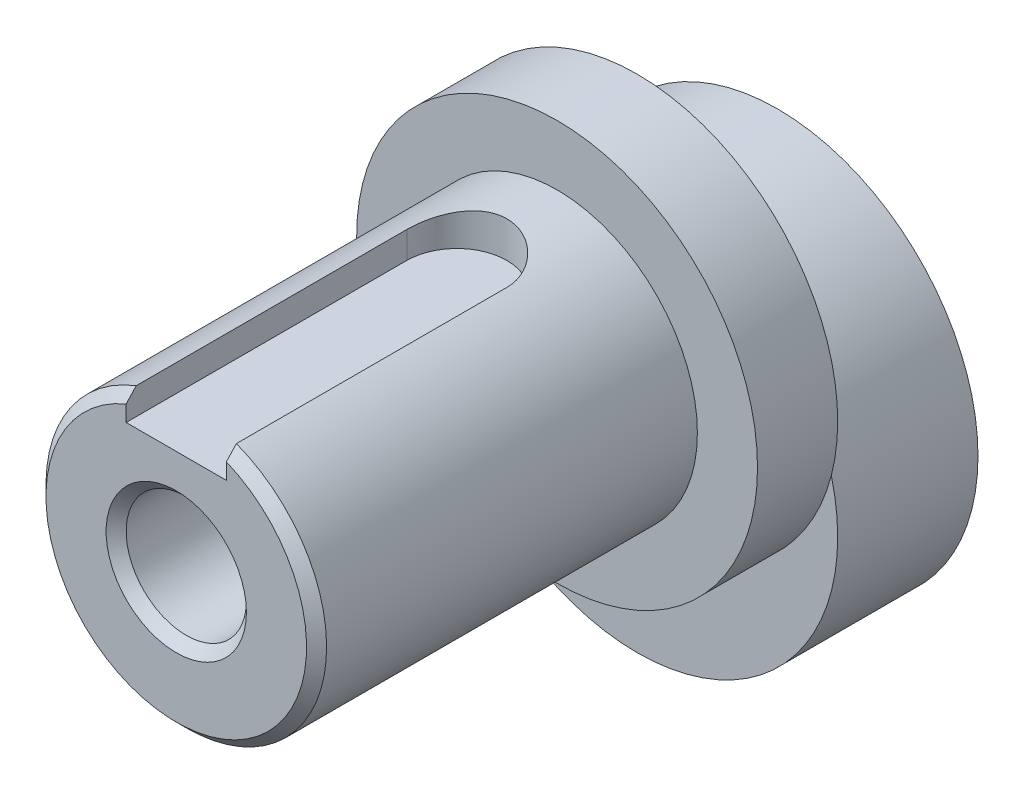
ISO-10303-21;
HEADER;
FILE_DESCRIPTION(('STEP AP214'),'2;1');
FILE_NAME('part.step','',(''),(''),'','','');
FILE_SCHEMA(('AUTOMOTIVE_DESIGN { 1 0 10303 214 1 1 1 1 }'));
ENDSEC;
DATA;
#1=APPLICATION_CONTEXT('core data for automotive mechanical design processes');
#2=APPLICATION_PROTOCOL_DEFINITION('international standard','automotive_design',2000,#1);
#3=PRODUCT_CONTEXT('',#1,'mechanical');
#4=PRODUCT('Part','Part','',(#3));
#5=PRODUCT_RELATED_PRODUCT_CATEGORY('part','',(#4));
#6=PRODUCT_DEFINITION_FORMATION('','',#4);
#7=PRODUCT_DEFINITION_CONTEXT('part definition',#1,'design');
#8=PRODUCT_DEFINITION('design','',#6,#7);
#9=PRODUCT_DEFINITION_SHAPE('','',#8);
#10=(LENGTH_UNIT() NAMED_UNIT(*) SI_UNIT(.MILLI.,.METRE.));
#11=(NAMED_UNIT(*) PLANE_ANGLE_UNIT() SI_UNIT($,.RADIAN.));
#12=(NAMED_UNIT(*) SI_UNIT($,.STERADIAN.) SOLID_ANGLE_UNIT());
#13=UNCERTAINTY_MEASURE_WITH_UNIT(LENGTH_MEASURE(1.E-05),#10,'distance_accuracy_value','');
#14=(GEOMETRIC_REPRESENTATION_CONTEXT(3) GLOBAL_UNCERTAINTY_ASSIGNED_CONTEXT((#13)) GLOBAL_UNIT_ASSIGNED_CONTEXT((#10,
#11,#12)) REPRESENTATION_CONTEXT('',''));
#15=CARTESIAN_POINT('',(0.,0.,0.));
#16=DIRECTION('',(0.,0.,1.));
#17=DIRECTION('',(1.,0.,0.));
#18=AXIS2_PLACEMENT_3D('',#15,#16,#17);
#19=CARTESIAN_POINT('',(0.,5.,30.));
#20=DIRECTION('',(0.,0.,-1.));
#21=DIRECTION('',(-1.,0.,0.));
#22=AXIS2_PLACEMENT_3D('',#19,#20,#21);
#23=CYLINDRICAL_SURFACE('',#22,7.);
#24=CARTESIAN_POINT('',(0.,5.,11.));
#25=DIRECTION('',(0.,0.,1.));
#26=DIRECTION('',(1.,0.,0.));
#27=AXIS2_PLACEMENT_3D('',#24,#25,#26);
#28=CIRCLE('',#27,7.);
#29=CARTESIAN_POINT('',(7.,5.,11.));
#30=VERTEX_POINT('',#29);
#31=EDGE_CURVE('E136',#30,#30,#28,.T.);
#32=ORIENTED_EDGE('',*,*,#31,.T.);
#33=EDGE_LOOP('',(#32));
#34=FACE_BOUND('',#33,.T.);
#35=DIRECTION('',(0.,0.,-1.));
#36=VECTOR('',#35,1.);
#37=CARTESIAN_POINT('',(2.5,11.538348415311,30.));
#38=LINE('',#37,#36);
#39=CARTESIAN_POINT('',(2.5,11.538348415311,16.));
#40=VERTEX_POINT('',#39);
#41=CARTESIAN_POINT('',(2.5,11.538348415311,29.5));
#42=VERTEX_POINT('',#41);
#43=EDGE_CURVE('E114',#40,#42,#38,.F.);
#44=ORIENTED_EDGE('',*,*,#43,.T.);
#45=CARTESIAN_POINT('',(0.,5.,29.5));
#46=DIRECTION('',(0.,0.,1.));
#47=DIRECTION('',(1.,0.,0.));
#48=AXIS2_PLACEMENT_3D('',#45,#46,#47);
#49=CIRCLE('',#48,7.);
#50=CARTESIAN_POINT('',(-2.5,11.538348415311,29.5));
#51=VERTEX_POINT('',#50);
#52=EDGE_CURVE('E60',#42,#51,#49,.F.);
#53=ORIENTED_EDGE('',*,*,#52,.T.);
#54=DIRECTION('',(0.,0.,-1.));
#55=VECTOR('',#54,1.);
#56=CARTESIAN_POINT('',(-2.5,11.538348415311,30.));
#57=LINE('',#56,#55);
#58=CARTESIAN_POINT('',(-2.5,11.538348415311,16.));
#59=VERTEX_POINT('',#58);
#60=EDGE_CURVE('E133',#59,#51,#57,.F.);
#61=ORIENTED_EDGE('',*,*,#60,.F.);
#62=CARTESIAN_POINT('',(2.5,11.538348415311,16.));
#63=CARTESIAN_POINT('',(2.50000932220904,11.5383365378513,15.9321107542711));
#64=CARTESIAN_POINT('',(2.49723485076694,11.5394054992274,15.8642280673609));
#65=CARTESIAN_POINT('',(2.4861910211816,11.5436165747813,15.7289960893886));
#66=CARTESIAN_POINT('',(2.47792334551208,11.5467580541806,15.6616466413939));
#67=CARTESIAN_POINT('',(2.456001752859,11.5550121763794,15.5281785853972));
#68=CARTESIAN_POINT('',(2.44236559963955,11.5601183170568,15.4620566636602));
#69=CARTESIAN_POINT('',(2.40985115466648,11.5721317785417,15.3312981648915));
#70=CARTESIAN_POINT('',(2.39097263107436,11.5790391790075,15.2666616536876));
#71=CARTESIAN_POINT('',(2.32673964179205,11.6021493436571,15.0757356335225));
#72=CARTESIAN_POINT('',(2.27375112606986,11.6207547534084,14.9522095478644));
#73=CARTESIAN_POINT('',(2.14910757865425,11.6622539736071,14.715769666872));
#74=CARTESIAN_POINT('',(2.07743895048849,11.6851509042488,14.6028636832645));
#75=CARTESIAN_POINT('',(1.9140257110197,11.7337991379222,14.3857847866473));
#76=CARTESIAN_POINT('',(1.82158337146744,11.7596286404137,14.2821535248041));
#77=CARTESIAN_POINT('',(1.6207338877633,11.8105759232303,14.0914912952836));
#78=CARTESIAN_POINT('',(1.51232377552674,11.8356935701987,14.0044634207566));
#79=CARTESIAN_POINT('',(1.27853915335934,11.8833113327905,13.846910144545));
#80=CARTESIAN_POINT('',(1.15274833789185,11.905708352238,13.7769684781395));
#81=CARTESIAN_POINT('',(0.890250825476635,11.9444235767263,13.6594633532026));
#82=CARTESIAN_POINT('',(0.753547890540327,11.9607438658547,13.611892220954));
#83=CARTESIAN_POINT('',(0.478829979256175,11.9849105051071,13.5423593978176));
#84=CARTESIAN_POINT('',(0.341079835227466,11.9930659435251,13.5194608695289));
#85=CARTESIAN_POINT('',(0.0634643052969036,12.0010879805382,13.4969315972224));
#86=CARTESIAN_POINT('',(-0.0764004845074483,12.000956873027,13.4972944139653));
#87=CARTESIAN_POINT('',(-0.347593258486946,11.9926225804908,13.5207112737611));
#88=CARTESIAN_POINT('',(-0.479022407078721,11.9847824358352,13.5427447941985));
#89=CARTESIAN_POINT('',(-0.736175812143608,11.9623783250735,13.6071734241588));
#90=CARTESIAN_POINT('',(-0.861899745780465,11.9478139789904,13.6495696843625));
#91=CARTESIAN_POINT('',(-1.10616102429807,11.9131650689037,13.7540469115653));
#92=CARTESIAN_POINT('',(-1.22457279066906,11.8930059216431,13.8163957149601));
#93=CARTESIAN_POINT('',(-1.44953531305523,11.8492335561632,13.9587793352234));
#94=CARTESIAN_POINT('',(-1.55608245176771,11.8256192895926,14.0388195237836));
#95=CARTESIAN_POINT('',(-1.7603244525607,11.7759054780549,14.2193232636567));
#96=CARTESIAN_POINT('',(-1.85724185700418,11.7497405584388,14.3206497231449));
#97=CARTESIAN_POINT('',(-2.03299914621297,11.6989034246897,14.5383273641656));
#98=CARTESIAN_POINT('',(-2.11183255456462,11.6742317476526,14.6546839051685));
#99=CARTESIAN_POINT('',(-2.25049860898459,11.628778038754,14.901942598522));
#100=CARTESIAN_POINT('',(-2.30994207989626,11.6080787511899,15.0330789755054));
#101=CARTESIAN_POINT('',(-2.4055543972585,11.5738821361027,15.3043648015822));
#102=CARTESIAN_POINT('',(-2.44176119399954,11.5603730716505,15.444499141169));
#103=CARTESIAN_POINT('',(-2.47705497148627,11.5470854224556,15.6550305442642));
#104=CARTESIAN_POINT('',(-2.48565347586445,11.5438201096791,15.7237363017718));
#105=CARTESIAN_POINT('',(-2.49712352174882,11.5394491082968,15.8616151641917));
#106=CARTESIAN_POINT('',(-2.50000139665367,11.5383410314093,15.9307876671005));
#107=CARTESIAN_POINT('',(-2.5,11.538348415311,16.));
#108=B_SPLINE_CURVE_WITH_KNOTS('',3,(#62,#63,#64,#65,#66,#67,#68,#69,#70,#71,#72,#73,#74,#75,
#76,#77,#78,#79,#80,#81,#82,#83,#84,#85,#86,#87,#88,#89,#90,#91,#92,#93,#94,#95,#96,#97,#98,#99,
#100,#101,#102,#103,#104,#105,#106,#107),.UNSPECIFIED.,.F.,.F.,(4,2,2,2,2,2,2,2,2,2,2,2,2,2,2,2,
2,2,2,2,2,2,4),(0.,0.203591628551589,0.40712092922553,0.609982356545745,0.812852756635989,
1.21793118555512,1.6233052814847,2.0451597231193,2.4670926781184,2.90188398965561,
3.33652604665238,3.75400993940862,4.17137826416923,4.56998920861347,4.96862268086888,
5.3728490944864,5.77719841367922,6.20315837945088,6.62927065674721,7.06347329058505,
7.49696496492445,7.70468580162773,7.91217653896404),.UNSPECIFIED.);
#109=EDGE_CURVE('E112',#40,#59,#108,.T.);
#110=ORIENTED_EDGE('',*,*,#109,.F.);
#111=EDGE_LOOP('',(#44,#53,#61,#110));
#112=FACE_BOUND('',#111,.T.);
#113=ADVANCED_FACE('F45',(#34,#112),#23,.T.);
#114=CARTESIAN_POINT('',(0.,5.,30.));
#115=DIRECTION('',(0.,0.,1.));
#116=DIRECTION('',(1.,0.,0.));
#117=AXIS2_PLACEMENT_3D('',#114,#115,#116);
#118=PLANE('',#117);
#119=CARTESIAN_POINT('',(0.,5.,30.));
#120=DIRECTION('',(0.,0.,1.));
#121=DIRECTION('',(1.,0.,0.));
#122=AXIS2_PLACEMENT_3D('',#119,#120,#121);
#123=CIRCLE('',#122,3.50000000000001);
#124=CARTESIAN_POINT('',(3.50000000000001,5.,30.));
#125=VERTEX_POINT('',#124);
#126=EDGE_CURVE('E161',#125,#125,#123,.F.);
#127=ORIENTED_EDGE('',*,*,#126,.T.);
#128=EDGE_LOOP('',(#127));
#129=FACE_BOUND('',#128,.T.);
#130=DIRECTION('',(0.,1.,0.));
#131=VECTOR('',#130,1.);
#132=CARTESIAN_POINT('',(-2.5,5.,30.));
#133=LINE('',#132,#131);
#134=CARTESIAN_POINT('',(-2.5,10.2,30.));
#135=VERTEX_POINT('',#134);
#136=CARTESIAN_POINT('',(-2.5,11.,30.));
#137=VERTEX_POINT('',#136);
#138=EDGE_CURVE('E121',#135,#137,#133,.T.);
#139=ORIENTED_EDGE('',*,*,#138,.T.);
#140=CARTESIAN_POINT('',(0.,5.,30.));
#141=DIRECTION('',(0.,0.,1.));
#142=DIRECTION('',(1.,0.,0.));
#143=AXIS2_PLACEMENT_3D('',#140,#141,#142);
#144=CIRCLE('',#143,6.5);
#145=CARTESIAN_POINT('',(2.5,11.,30.));
#146=VERTEX_POINT('',#145);
#147=EDGE_CURVE('E176',#137,#146,#144,.T.);
#148=ORIENTED_EDGE('',*,*,#147,.T.);
#149=DIRECTION('',(0.,1.,0.));
#150=VECTOR('',#149,1.);
#151=CARTESIAN_POINT('',(2.5,5.,30.));
#152=LINE('',#151,#150);
#153=CARTESIAN_POINT('',(2.5,10.2,30.));
#154=VERTEX_POINT('',#153);
#155=EDGE_CURVE('E166',#154,#146,#152,.T.);
#156=ORIENTED_EDGE('',*,*,#155,.F.);
#157=DIRECTION('',(-1.,0.,0.));
#158=VECTOR('',#157,1.);
#159=CARTESIAN_POINT('',(0.,10.2,30.));
#160=LINE('',#159,#158);
#161=EDGE_CURVE('E164',#154,#135,#160,.T.);
#162=ORIENTED_EDGE('',*,*,#161,.T.);
#163=EDGE_LOOP('',(#139,#148,#156,#162));
#164=FACE_BOUND('',#163,.T.);
#165=ADVANCED_FACE('F192',(#129,#164),#118,.T.);
#166=CARTESIAN_POINT('',(0.,0.,7.));
#167=DIRECTION('',(0.,0.,-1.));
#168=DIRECTION('',(-1.,0.,0.));
#169=AXIS2_PLACEMENT_3D('',#166,#167,#168);
#170=CYLINDRICAL_SURFACE('',#169,10.);
#171=CARTESIAN_POINT('',(0.,0.,7.));
#172=DIRECTION('',(0.,0.,1.));
#173=DIRECTION('',(1.,0.,0.));
#174=AXIS2_PLACEMENT_3D('',#171,#172,#173);
#175=CIRCLE('',#174,10.);
#176=CARTESIAN_POINT('',(9.68245836551854,2.5,7.));
#177=VERTEX_POINT('',#176);
#178=CARTESIAN_POINT('',(-9.68245836551854,2.5,7.));
#179=VERTEX_POINT('',#178);
#180=EDGE_CURVE('E140',#177,#179,#175,.T.);
#181=ORIENTED_EDGE('',*,*,#180,.F.);
#182=EDGE_CURVE('E150',#179,#177,#175,.T.);
#183=ORIENTED_EDGE('',*,*,#182,.F.);
#184=EDGE_LOOP('',(#181,#183));
#185=FACE_BOUND('',#184,.T.);
#186=CARTESIAN_POINT('',(0.,0.,0.));
#187=DIRECTION('',(0.,0.,1.));
#188=DIRECTION('',(1.,0.,0.));
#189=AXIS2_PLACEMENT_3D('',#186,#187,#188);
#190=CIRCLE('',#189,10.);
#191=CARTESIAN_POINT('',(10.,0.,0.));
#192=VERTEX_POINT('',#191);
#193=EDGE_CURVE('E144',#192,#192,#190,.T.);
#194=ORIENTED_EDGE('',*,*,#193,.T.);
#195=EDGE_LOOP('',(#194));
#196=FACE_BOUND('',#195,.T.);
#197=ADVANCED_FACE('F194',(#185,#196),#170,.T.);
#198=CARTESIAN_POINT('',(0.,0.,7.));
#199=DIRECTION('',(0.,0.,1.));
#200=DIRECTION('',(1.,0.,0.));
#201=AXIS2_PLACEMENT_3D('',#198,#199,#200);
#202=PLANE('',#201);
#203=CARTESIAN_POINT('',(0.,5.,7.));
#204=DIRECTION('',(0.,0.,1.));
#205=DIRECTION('',(1.,0.,0.));
#206=AXIS2_PLACEMENT_3D('',#203,#204,#205);
#207=CIRCLE('',#206,10.);
#208=EDGE_CURVE('E145',#179,#177,#207,.T.);
#209=ORIENTED_EDGE('',*,*,#208,.F.);
#210=ORIENTED_EDGE('',*,*,#182,.T.);
#211=EDGE_LOOP('',(#209,#210));
#212=FACE_BOUND('',#211,.T.);
#213=ADVANCED_FACE('F200',(#212),#202,.T.);
#214=CARTESIAN_POINT('',(0.,0.,0.));
#215=DIRECTION('',(0.,0.,1.));
#216=DIRECTION('',(1.,0.,0.));
#217=AXIS2_PLACEMENT_3D('',#214,#215,#216);
#218=PLANE('',#217);
#219=CARTESIAN_POINT('',(0.,5.,0.));
#220=DIRECTION('',(0.,0.,1.));
#221=DIRECTION('',(1.,0.,0.));
#222=AXIS2_PLACEMENT_3D('',#219,#220,#221);
#223=CIRCLE('',#222,3.5);
#224=CARTESIAN_POINT('',(3.5,5.,0.));
#225=VERTEX_POINT('',#224);
#226=EDGE_CURVE('E139',#225,#225,#223,.T.);
#227=ORIENTED_EDGE('',*,*,#226,.T.);
#228=EDGE_LOOP('',(#227));
#229=FACE_BOUND('',#228,.T.);
#230=ORIENTED_EDGE('',*,*,#193,.F.);
#231=EDGE_LOOP('',(#230));
#232=FACE_BOUND('',#231,.T.);
#233=ADVANCED_FACE('F302',(#229,#232),#218,.F.);
#234=CARTESIAN_POINT('',(0.,5.,7.));
#235=DIRECTION('',(0.,0.,1.));
#236=DIRECTION('',(1.,0.,0.));
#237=AXIS2_PLACEMENT_3D('',#234,#235,#236);
#238=PLANE('',#237);
#239=EDGE_CURVE('E135',#177,#179,#207,.T.);
#240=ORIENTED_EDGE('',*,*,#239,.F.);
#241=ORIENTED_EDGE('',*,*,#180,.T.);
#242=EDGE_LOOP('',(#240,#241));
#243=FACE_BOUND('',#242,.T.);
#244=ADVANCED_FACE('F292',(#243),#238,.F.);
#245=CARTESIAN_POINT('',(0.,5.,11.));
#246=DIRECTION('',(0.,0.,-1.));
#247=DIRECTION('',(-1.,0.,0.));
#248=AXIS2_PLACEMENT_3D('',#245,#246,#247);
#249=CYLINDRICAL_SURFACE('',#248,10.);
#250=CARTESIAN_POINT('',(0.,5.,11.));
#251=DIRECTION('',(0.,0.,1.));
#252=DIRECTION('',(1.,0.,0.));
#253=AXIS2_PLACEMENT_3D('',#250,#251,#252);
#254=CIRCLE('',#253,10.);
#255=CARTESIAN_POINT('',(10.,5.,11.));
#256=VERTEX_POINT('',#255);
#257=EDGE_CURVE('E141',#256,#256,#254,.T.);
#258=ORIENTED_EDGE('',*,*,#257,.F.);
#259=EDGE_LOOP('',(#258));
#260=FACE_BOUND('',#259,.T.);
#261=ORIENTED_EDGE('',*,*,#208,.T.);
#262=ORIENTED_EDGE('',*,*,#239,.T.);
#263=EDGE_LOOP('',(#261,#262));
#264=FACE_BOUND('',#263,.T.);
#265=ADVANCED_FACE('F283',(#260,#264),#249,.T.);
#266=CARTESIAN_POINT('',(0.,5.,11.));
#267=DIRECTION('',(0.,0.,1.));
#268=DIRECTION('',(1.,0.,0.));
#269=AXIS2_PLACEMENT_3D('',#266,#267,#268);
#270=PLANE('',#269);
#271=ORIENTED_EDGE('',*,*,#31,.F.);
#272=EDGE_LOOP('',(#271));
#273=FACE_BOUND('',#272,.T.);
#274=ORIENTED_EDGE('',*,*,#257,.T.);
#275=EDGE_LOOP('',(#274));
#276=FACE_BOUND('',#275,.T.);
#277=ADVANCED_FACE('F190',(#273,#276),#270,.T.);
#278=CARTESIAN_POINT('',(0.,5.,0.));
#279=DIRECTION('',(0.,0.,1.));
#280=DIRECTION('',(1.,0.,0.));
#281=AXIS2_PLACEMENT_3D('',#278,#279,#280);
#282=CYLINDRICAL_SURFACE('',#281,3.);
#283=CARTESIAN_POINT('',(0.,5.,0.500000000000003));
#284=DIRECTION('',(0.,0.,1.));
#285=DIRECTION('',(1.,0.,0.));
#286=AXIS2_PLACEMENT_3D('',#283,#284,#285);
#287=CIRCLE('',#286,3.);
#288=CARTESIAN_POINT('',(3.,5.,0.500000000000003));
#289=VERTEX_POINT('',#288);
#290=EDGE_CURVE('E158',#289,#289,#287,.F.);
#291=ORIENTED_EDGE('',*,*,#290,.T.);
#292=EDGE_LOOP('',(#291));
#293=FACE_BOUND('',#292,.T.);
#294=CARTESIAN_POINT('',(0.,5.,29.5));
#295=DIRECTION('',(0.,0.,1.));
#296=DIRECTION('',(1.,0.,0.));
#297=AXIS2_PLACEMENT_3D('',#294,#295,#296);
#298=CIRCLE('',#297,3.);
#299=CARTESIAN_POINT('',(3.,5.,29.5));
#300=VERTEX_POINT('',#299);
#301=EDGE_CURVE('E155',#300,#300,#298,.T.);
#302=ORIENTED_EDGE('',*,*,#301,.T.);
#303=EDGE_LOOP('',(#302));
#304=FACE_BOUND('',#303,.T.);
#305=ADVANCED_FACE('F187',(#293,#304),#282,.F.);
#306=CARTESIAN_POINT('',(0.,5.,0.));
#307=DIRECTION('',(0.,0.,-1.));
#308=DIRECTION('',(-1.,0.,0.));
#309=AXIS2_PLACEMENT_3D('',#306,#307,#308);
#310=CONICAL_SURFACE('',#309,3.5,0.785398163397445);
#311=ORIENTED_EDGE('',*,*,#290,.F.);
#312=EDGE_LOOP('',(#311));
#313=FACE_BOUND('',#312,.T.);
#314=ORIENTED_EDGE('',*,*,#226,.F.);
#315=EDGE_LOOP('',(#314));
#316=FACE_BOUND('',#315,.T.);
#317=ADVANCED_FACE('F189',(#313,#316),#310,.F.);
#318=CARTESIAN_POINT('',(0.,5.,29.5));
#319=DIRECTION('',(0.,0.,1.));
#320=DIRECTION('',(1.,0.,0.));
#321=AXIS2_PLACEMENT_3D('',#318,#319,#320);
#322=CONICAL_SURFACE('',#321,3.,0.785398163397458);
#323=ORIENTED_EDGE('',*,*,#126,.F.);
#324=EDGE_LOOP('',(#323));
#325=FACE_BOUND('',#324,.T.);
#326=ORIENTED_EDGE('',*,*,#301,.F.);
#327=EDGE_LOOP('',(#326));
#328=FACE_BOUND('',#327,.T.);
#329=ADVANCED_FACE('F184',(#325,#328),#322,.F.);
#330=CARTESIAN_POINT('',(0.,15.,16.));
#331=DIRECTION('',(0.,-1.,0.));
#332=DIRECTION('',(0.,0.,-1.));
#333=AXIS2_PLACEMENT_3D('',#330,#331,#332);
#334=CYLINDRICAL_SURFACE('',#333,2.5);
#335=ORIENTED_EDGE('',*,*,#109,.T.);
#336=DIRECTION('',(0.,-1.,0.));
#337=VECTOR('',#336,1.);
#338=CARTESIAN_POINT('',(-2.5,15.,16.));
#339=LINE('',#338,#337);
#340=CARTESIAN_POINT('',(-2.5,10.2,16.));
#341=VERTEX_POINT('',#340);
#342=EDGE_CURVE('E104',#59,#341,#339,.T.);
#343=ORIENTED_EDGE('',*,*,#342,.T.);
#344=CARTESIAN_POINT('',(0.,10.2,16.));
#345=DIRECTION('',(0.,1.,0.));
#346=DIRECTION('',(0.,0.,1.));
#347=AXIS2_PLACEMENT_3D('',#344,#345,#346);
#348=CIRCLE('',#347,2.5);
#349=CARTESIAN_POINT('',(2.5,10.2,16.));
#350=VERTEX_POINT('',#349);
#351=EDGE_CURVE('E109',#350,#341,#348,.T.);
#352=ORIENTED_EDGE('',*,*,#351,.F.);
#353=DIRECTION('',(0.,-1.,0.));
#354=VECTOR('',#353,1.);
#355=CARTESIAN_POINT('',(2.5,15.,16.));
#356=LINE('',#355,#354);
#357=EDGE_CURVE('E115',#40,#350,#356,.T.);
#358=ORIENTED_EDGE('',*,*,#357,.F.);
#359=EDGE_LOOP('',(#335,#343,#352,#358));
#360=FACE_BOUND('',#359,.T.);
#361=ADVANCED_FACE('F106',(#360),#334,.F.);
#362=CARTESIAN_POINT('',(-2.5,15.,16.));
#363=DIRECTION('',(1.,0.,0.));
#364=DIRECTION('',(0.,0.,-1.));
#365=AXIS2_PLACEMENT_3D('',#362,#363,#364);
#366=PLANE('',#365);
#367=ORIENTED_EDGE('',*,*,#60,.T.);
#368=CARTESIAN_POINT('',(-2.5,11.538348415311,29.5));
#369=CARTESIAN_POINT('',(-2.5,11.4488688143681,29.5835972549309));
#370=CARTESIAN_POINT('',(-2.5,11.3592666495585,29.6670625457351));
#371=CARTESIAN_POINT('',(-2.5,11.1798171778274,29.833729212444));
#372=CARTESIAN_POINT('',(-2.5,11.0899698708667,29.9169305883065));
#373=CARTESIAN_POINT('',(-2.5,11.,30.));
#374=B_SPLINE_CURVE_WITH_KNOTS('',3,(#368,#369,#370,#371,#372,#373),.UNSPECIFIED.,.F.,.F.,(4,2,
4),(0.,0.36736225223653,0.734724563343169),.UNSPECIFIED.);
#375=EDGE_CURVE('E11',#51,#137,#374,.T.);
#376=ORIENTED_EDGE('',*,*,#375,.T.);
#377=ORIENTED_EDGE('',*,*,#138,.F.);
#378=DIRECTION('',(0.,0.,1.));
#379=VECTOR('',#378,1.);
#380=CARTESIAN_POINT('',(-2.5,10.2,16.));
#381=LINE('',#380,#379);
#382=EDGE_CURVE('E118',#341,#135,#381,.T.);
#383=ORIENTED_EDGE('',*,*,#382,.F.);
#384=ORIENTED_EDGE('',*,*,#342,.F.);
#385=EDGE_LOOP('',(#367,#376,#377,#383,#384));
#386=FACE_BOUND('',#385,.T.);
#387=ADVANCED_FACE('F119',(#386),#366,.T.);
#388=CARTESIAN_POINT('',(2.5,15.,16.));
#389=DIRECTION('',(1.,0.,0.));
#390=DIRECTION('',(0.,0.,-1.));
#391=AXIS2_PLACEMENT_3D('',#388,#389,#390);
#392=PLANE('',#391);
#393=ORIENTED_EDGE('',*,*,#155,.T.);
#394=CARTESIAN_POINT('',(2.5,11.,30.));
#395=CARTESIAN_POINT('',(2.5,11.0899698708667,29.9169305883065));
#396=CARTESIAN_POINT('',(2.5,11.1798171778274,29.833729212444));
#397=CARTESIAN_POINT('',(2.5,11.3592666495585,29.6670625457351));
#398=CARTESIAN_POINT('',(2.5,11.4488688143681,29.5835972549309));
#399=CARTESIAN_POINT('',(2.5,11.538348415311,29.5));
#400=B_SPLINE_CURVE_WITH_KNOTS('',3,(#394,#395,#396,#397,#398,#399),.UNSPECIFIED.,.F.,.F.,(4,2,
4),(0.,0.367362311106639,0.734724563343169),.UNSPECIFIED.);
#401=EDGE_CURVE('E74',#146,#42,#400,.T.);
#402=ORIENTED_EDGE('',*,*,#401,.T.);
#403=ORIENTED_EDGE('',*,*,#43,.F.);
#404=ORIENTED_EDGE('',*,*,#357,.T.);
#405=DIRECTION('',(0.,0.,1.));
#406=VECTOR('',#405,1.);
#407=CARTESIAN_POINT('',(2.5,10.2,16.));
#408=LINE('',#407,#406);
#409=EDGE_CURVE('E124',#350,#154,#408,.T.);
#410=ORIENTED_EDGE('',*,*,#409,.T.);
#411=EDGE_LOOP('',(#393,#402,#403,#404,#410));
#412=FACE_BOUND('',#411,.T.);
#413=ADVANCED_FACE('F215',(#412),#392,.F.);
#414=CARTESIAN_POINT('',(0.,10.2,16.));
#415=DIRECTION('',(0.,1.,0.));
#416=DIRECTION('',(0.,0.,1.));
#417=AXIS2_PLACEMENT_3D('',#414,#415,#416);
#418=PLANE('',#417);
#419=ORIENTED_EDGE('',*,*,#409,.F.);
#420=ORIENTED_EDGE('',*,*,#351,.T.);
#421=ORIENTED_EDGE('',*,*,#382,.T.);
#422=ORIENTED_EDGE('',*,*,#161,.F.);
#423=EDGE_LOOP('',(#419,#420,#421,#422));
#424=FACE_BOUND('',#423,.T.);
#425=ADVANCED_FACE('F126',(#424),#418,.T.);
#426=CARTESIAN_POINT('',(0.,5.,30.));
#427=DIRECTION('',(0.,0.,-1.));
#428=DIRECTION('',(-1.,0.,0.));
#429=AXIS2_PLACEMENT_3D('',#426,#427,#428);
#430=CONICAL_SURFACE('',#429,6.5,0.785398163397449);
#431=ORIENTED_EDGE('',*,*,#375,.F.);
#432=ORIENTED_EDGE('',*,*,#52,.F.);
#433=ORIENTED_EDGE('',*,*,#401,.F.);
#434=ORIENTED_EDGE('',*,*,#147,.F.);
#435=EDGE_LOOP('',(#431,#432,#433,#434));
#436=FACE_BOUND('',#435,.T.);
#437=ADVANCED_FACE('F48',(#436),#430,.T.);
#438=CLOSED_SHELL('',(#113,#165,#197,#213,#233,#244,#265,#277,#305,#317,#329,#361,#387,#413,
#425,#437));
#439=MANIFOLD_SOLID_BREP('B2',#438);
#440=ADVANCED_BREP_SHAPE_REPRESENTATION('',(#18,#439),#14);
#441=SHAPE_DEFINITION_REPRESENTATION(#9,#440);
ENDSEC;
END-ISO-10303-21;
